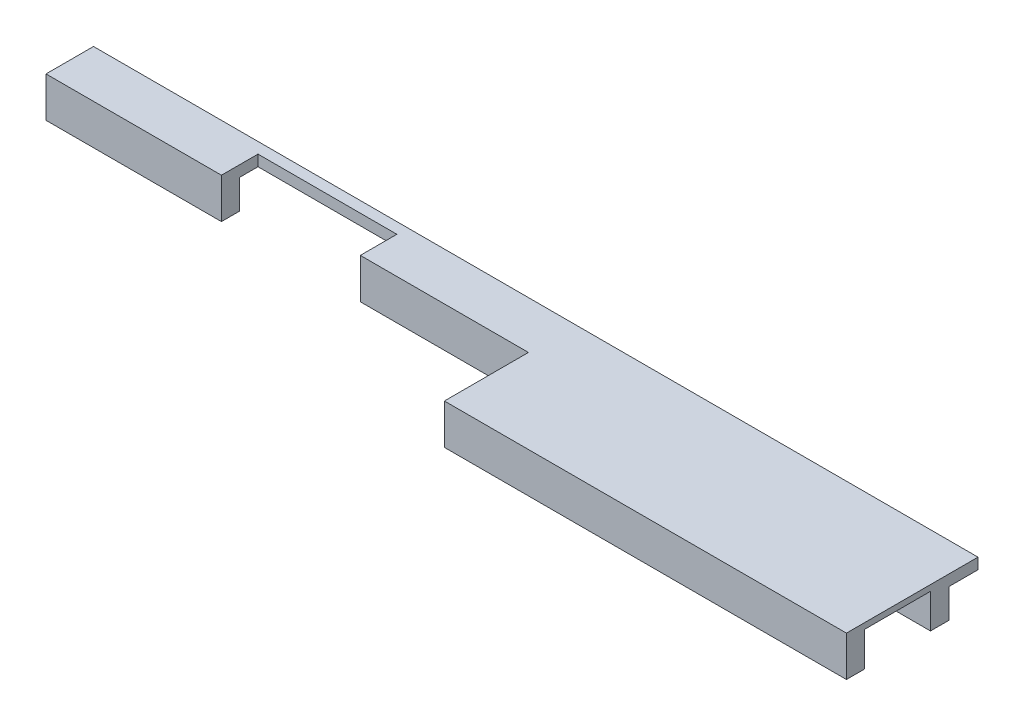
ISO-10303-21;
HEADER;
FILE_DESCRIPTION(('STEP AP214'),'2;1');
FILE_NAME('part.step','',(''),(''),'','','');
FILE_SCHEMA(('AUTOMOTIVE_DESIGN { 1 0 10303 214 1 1 1 1 }'));
ENDSEC;
DATA;
#1=APPLICATION_CONTEXT('core data for automotive mechanical design processes');
#2=APPLICATION_PROTOCOL_DEFINITION('international standard','automotive_design',2000,#1);
#3=PRODUCT_CONTEXT('',#1,'mechanical');
#4=PRODUCT('Part','Part','',(#3));
#5=PRODUCT_RELATED_PRODUCT_CATEGORY('part','',(#4));
#6=PRODUCT_DEFINITION_FORMATION('','',#4);
#7=PRODUCT_DEFINITION_CONTEXT('part definition',#1,'design');
#8=PRODUCT_DEFINITION('design','',#6,#7);
#9=PRODUCT_DEFINITION_SHAPE('','',#8);
#10=(LENGTH_UNIT() NAMED_UNIT(*) SI_UNIT(.MILLI.,.METRE.));
#11=(NAMED_UNIT(*) PLANE_ANGLE_UNIT() SI_UNIT($,.RADIAN.));
#12=(NAMED_UNIT(*) SI_UNIT($,.STERADIAN.) SOLID_ANGLE_UNIT());
#13=UNCERTAINTY_MEASURE_WITH_UNIT(LENGTH_MEASURE(1.E-05),#10,'distance_accuracy_value','');
#14=(GEOMETRIC_REPRESENTATION_CONTEXT(3) GLOBAL_UNCERTAINTY_ASSIGNED_CONTEXT((#13)) GLOBAL_UNIT_ASSIGNED_CONTEXT((#10,
#11,#12)) REPRESENTATION_CONTEXT('',''));
#15=CARTESIAN_POINT('',(0.,0.,0.));
#16=DIRECTION('',(0.,0.,1.));
#17=DIRECTION('',(1.,0.,0.));
#18=AXIS2_PLACEMENT_3D('',#15,#16,#17);
#19=CARTESIAN_POINT('',(-60.,-3.,68.5));
#20=DIRECTION('',(0.,0.,-1.));
#21=DIRECTION('',(-1.,0.,0.));
#22=AXIS2_PLACEMENT_3D('',#19,#20,#21);
#23=PLANE('',#22);
#24=DIRECTION('',(1.,0.,0.));
#25=VECTOR('',#24,1.);
#26=CARTESIAN_POINT('',(-60.,0.,68.5));
#27=LINE('',#26,#25);
#28=CARTESIAN_POINT('',(-67.,0.,68.5));
#29=VERTEX_POINT('',#28);
#30=CARTESIAN_POINT('',(-19.,0.,68.5));
#31=VERTEX_POINT('',#30);
#32=EDGE_CURVE('E195',#29,#31,#27,.T.);
#33=ORIENTED_EDGE('',*,*,#32,.F.);
#34=DIRECTION('',(0.,-1.,0.));
#35=VECTOR('',#34,1.);
#36=CARTESIAN_POINT('',(-67.,-11.,68.5));
#37=LINE('',#36,#35);
#38=CARTESIAN_POINT('',(-67.,-11.,68.5));
#39=VERTEX_POINT('',#38);
#40=EDGE_CURVE('E276',#29,#39,#37,.T.);
#41=ORIENTED_EDGE('',*,*,#40,.T.);
#42=DIRECTION('',(1.,0.,0.));
#43=VECTOR('',#42,1.);
#44=CARTESIAN_POINT('',(-60.,-11.,68.5));
#45=LINE('',#44,#43);
#46=CARTESIAN_POINT('',(-19.,-11.,68.5));
#47=VERTEX_POINT('',#46);
#48=EDGE_CURVE('E316',#39,#47,#45,.T.);
#49=ORIENTED_EDGE('',*,*,#48,.T.);
#50=DIRECTION('',(0.,-1.,0.));
#51=VECTOR('',#50,1.);
#52=CARTESIAN_POINT('',(-19.,14.,68.5));
#53=LINE('',#52,#51);
#54=EDGE_CURVE('E291',#31,#47,#53,.T.);
#55=ORIENTED_EDGE('',*,*,#54,.F.);
#56=EDGE_LOOP('',(#33,#41,#49,#55));
#57=FACE_BOUND('',#56,.T.);
#58=ADVANCED_FACE('F39',(#57),#23,.F.);
#59=CARTESIAN_POINT('',(-60.,-11.,63.5));
#60=DIRECTION('',(0.,0.,1.));
#61=DIRECTION('',(1.,0.,0.));
#62=AXIS2_PLACEMENT_3D('',#59,#60,#61);
#63=PLANE('',#62);
#64=DIRECTION('',(-1.,0.,0.));
#65=VECTOR('',#64,1.);
#66=CARTESIAN_POINT('',(-60.,-11.,63.5));
#67=LINE('',#66,#65);
#68=CARTESIAN_POINT('',(-19.,-11.,63.5));
#69=VERTEX_POINT('',#68);
#70=CARTESIAN_POINT('',(-67.,-11.,63.5));
#71=VERTEX_POINT('',#70);
#72=EDGE_CURVE('E319',#69,#71,#67,.T.);
#73=ORIENTED_EDGE('',*,*,#72,.T.);
#74=DIRECTION('',(0.,1.,0.));
#75=VECTOR('',#74,1.);
#76=CARTESIAN_POINT('',(-67.,-11.,63.5));
#77=LINE('',#76,#75);
#78=CARTESIAN_POINT('',(-67.,-3.,63.5));
#79=VERTEX_POINT('',#78);
#80=EDGE_CURVE('E183',#71,#79,#77,.T.);
#81=ORIENTED_EDGE('',*,*,#80,.T.);
#82=DIRECTION('',(-1.,0.,0.));
#83=VECTOR('',#82,1.);
#84=CARTESIAN_POINT('',(-60.,-3.,63.5));
#85=LINE('',#84,#83);
#86=CARTESIAN_POINT('',(-19.,-3.,63.5));
#87=VERTEX_POINT('',#86);
#88=EDGE_CURVE('E164',#87,#79,#85,.T.);
#89=ORIENTED_EDGE('',*,*,#88,.F.);
#90=DIRECTION('',(0.,1.,0.));
#91=VECTOR('',#90,1.);
#92=CARTESIAN_POINT('',(-19.,-11.,63.5));
#93=LINE('',#92,#91);
#94=EDGE_CURVE('E172',#69,#87,#93,.T.);
#95=ORIENTED_EDGE('',*,*,#94,.F.);
#96=EDGE_LOOP('',(#73,#81,#89,#95));
#97=FACE_BOUND('',#96,.T.);
#98=ADVANCED_FACE('F182',(#97),#63,.F.);
#99=CARTESIAN_POINT('',(0.,-11.,0.));
#100=DIRECTION('',(0.,1.,0.));
#101=DIRECTION('',(0.,0.,-1.));
#102=AXIS2_PLACEMENT_3D('',#99,#100,#101);
#103=PLANE('',#102);
#104=ORIENTED_EDGE('',*,*,#48,.F.);
#105=DIRECTION('',(0.,0.,-1.));
#106=VECTOR('',#105,1.);
#107=CARTESIAN_POINT('',(-67.,-11.,63.5));
#108=LINE('',#107,#106);
#109=EDGE_CURVE('E106',#39,#71,#108,.T.);
#110=ORIENTED_EDGE('',*,*,#109,.T.);
#111=ORIENTED_EDGE('',*,*,#72,.F.);
#112=DIRECTION('',(0.,0.,-1.));
#113=VECTOR('',#112,1.);
#114=CARTESIAN_POINT('',(-19.,-11.,0.));
#115=LINE('',#114,#113);
#116=EDGE_CURVE('E50',#47,#69,#115,.T.);
#117=ORIENTED_EDGE('',*,*,#116,.F.);
#118=EDGE_LOOP('',(#104,#110,#111,#117));
#119=FACE_BOUND('',#118,.T.);
#120=ADVANCED_FACE('F390',(#119),#103,.F.);
#121=CARTESIAN_POINT('',(0.,-3.,0.));
#122=DIRECTION('',(0.,1.,0.));
#123=DIRECTION('',(0.,0.,-1.));
#124=AXIS2_PLACEMENT_3D('',#121,#122,#123);
#125=PLANE('',#124);
#126=CARTESIAN_POINT('',(175.,-3.,63.5));
#127=VERTEX_POINT('',#126);
#128=CARTESIAN_POINT('',(19.,-3.,63.5));
#129=VERTEX_POINT('',#128);
#130=EDGE_CURVE('E185',#127,#129,#85,.T.);
#131=ORIENTED_EDGE('',*,*,#130,.T.);
#132=DIRECTION('',(0.,0.,1.));
#133=VECTOR('',#132,1.);
#134=CARTESIAN_POINT('',(19.,-3.,0.));
#135=LINE('',#134,#133);
#136=CARTESIAN_POINT('',(19.,-3.,58.5));
#137=VERTEX_POINT('',#136);
#138=EDGE_CURVE('E308',#137,#129,#135,.T.);
#139=ORIENTED_EDGE('',*,*,#138,.F.);
#140=DIRECTION('',(1.,0.,0.));
#141=VECTOR('',#140,1.);
#142=CARTESIAN_POINT('',(0.,-3.,58.5));
#143=LINE('',#142,#141);
#144=CARTESIAN_POINT('',(-19.,-3.,58.5));
#145=VERTEX_POINT('',#144);
#146=EDGE_CURVE('E168',#145,#137,#143,.T.);
#147=ORIENTED_EDGE('',*,*,#146,.F.);
#148=DIRECTION('',(0.,0.,-1.));
#149=VECTOR('',#148,1.);
#150=CARTESIAN_POINT('',(-19.,-3.,0.));
#151=LINE('',#150,#149);
#152=EDGE_CURVE('E158',#87,#145,#151,.T.);
#153=ORIENTED_EDGE('',*,*,#152,.F.);
#154=ORIENTED_EDGE('',*,*,#88,.T.);
#155=DIRECTION('',(0.,0.,-1.));
#156=VECTOR('',#155,1.);
#157=CARTESIAN_POINT('',(-67.,-3.,63.5));
#158=LINE('',#157,#156);
#159=CARTESIAN_POINT('',(-67.,-3.,55.5));
#160=VERTEX_POINT('',#159);
#161=EDGE_CURVE('E267',#79,#160,#158,.T.);
#162=ORIENTED_EDGE('',*,*,#161,.T.);
#163=DIRECTION('',(-1.,0.,0.));
#164=VECTOR('',#163,1.);
#165=CARTESIAN_POINT('',(0.,-3.,55.5));
#166=LINE('',#165,#164);
#167=CARTESIAN_POINT('',(175.,-3.,55.5));
#168=VERTEX_POINT('',#167);
#169=EDGE_CURVE('E284',#168,#160,#166,.T.);
#170=ORIENTED_EDGE('',*,*,#169,.F.);
#171=DIRECTION('',(0.,0.,1.));
#172=VECTOR('',#171,1.);
#173=CARTESIAN_POINT('',(175.,-3.,0.));
#174=LINE('',#173,#172);
#175=EDGE_CURVE('E210',#168,#127,#174,.T.);
#176=ORIENTED_EDGE('',*,*,#175,.T.);
#177=EDGE_LOOP('',(#131,#139,#147,#153,#154,#162,#170,#176));
#178=FACE_BOUND('',#177,.T.);
#179=ADVANCED_FACE('F161',(#178),#125,.F.);
#180=DIRECTION('',(-1.,0.,0.));
#181=VECTOR('',#180,1.);
#182=CARTESIAN_POINT('',(180.,-1.6,68.5));
#183=LINE('',#182,#181);
#184=CARTESIAN_POINT('',(175.,-1.6,68.5));
#185=VERTEX_POINT('',#184);
#186=CARTESIAN_POINT('',(65.,-1.6,68.5));
#187=VERTEX_POINT('',#186);
#188=EDGE_CURVE('E259',#185,#187,#183,.T.);
#189=ORIENTED_EDGE('',*,*,#188,.T.);
#190=DIRECTION('',(0.,-1.,0.));
#191=VECTOR('',#190,1.);
#192=CARTESIAN_POINT('',(65.,0.,68.5));
#193=LINE('',#192,#191);
#194=CARTESIAN_POINT('',(65.,0.,68.5));
#195=VERTEX_POINT('',#194);
#196=EDGE_CURVE('E344',#195,#187,#193,.T.);
#197=ORIENTED_EDGE('',*,*,#196,.F.);
#198=CARTESIAN_POINT('',(19.,0.,68.5));
#199=VERTEX_POINT('',#198);
#200=EDGE_CURVE('E199',#199,#195,#27,.T.);
#201=ORIENTED_EDGE('',*,*,#200,.F.);
#202=DIRECTION('',(0.,-1.,0.));
#203=VECTOR('',#202,1.);
#204=CARTESIAN_POINT('',(19.,14.,68.5));
#205=LINE('',#204,#203);
#206=CARTESIAN_POINT('',(19.,-11.,68.5));
#207=VERTEX_POINT('',#206);
#208=EDGE_CURVE('E299',#199,#207,#205,.T.);
#209=ORIENTED_EDGE('',*,*,#208,.T.);
#210=CARTESIAN_POINT('',(175.,-11.,68.5));
#211=VERTEX_POINT('',#210);
#212=EDGE_CURVE('E189',#207,#211,#45,.T.);
#213=ORIENTED_EDGE('',*,*,#212,.T.);
#214=DIRECTION('',(0.,1.,0.));
#215=VECTOR('',#214,1.);
#216=CARTESIAN_POINT('',(175.,0.,68.5));
#217=LINE('',#216,#215);
#218=EDGE_CURVE('E222',#211,#185,#217,.T.);
#219=ORIENTED_EDGE('',*,*,#218,.T.);
#220=EDGE_LOOP('',(#189,#197,#201,#209,#213,#219));
#221=FACE_BOUND('',#220,.T.);
#222=ADVANCED_FACE('F326',(#221),#23,.F.);
#223=CARTESIAN_POINT('',(0.,0.,0.));
#224=DIRECTION('',(0.,1.,0.));
#225=DIRECTION('',(0.,0.,-1.));
#226=AXIS2_PLACEMENT_3D('',#223,#224,#225);
#227=PLANE('',#226);
#228=DIRECTION('',(0.,0.,1.));
#229=VECTOR('',#228,1.);
#230=CARTESIAN_POINT('',(65.,0.,91.5));
#231=LINE('',#230,#229);
#232=CARTESIAN_POINT('',(65.,0.,91.5));
#233=VERTEX_POINT('',#232);
#234=EDGE_CURVE('E354',#195,#233,#231,.T.);
#235=ORIENTED_EDGE('',*,*,#234,.T.);
#236=DIRECTION('',(-1.,0.,0.));
#237=VECTOR('',#236,1.);
#238=CARTESIAN_POINT('',(180.,0.,91.5));
#239=LINE('',#238,#237);
#240=CARTESIAN_POINT('',(175.,0.,91.5));
#241=VERTEX_POINT('',#240);
#242=EDGE_CURVE('E240',#241,#233,#239,.T.);
#243=ORIENTED_EDGE('',*,*,#242,.F.);
#244=DIRECTION('',(0.,0.,-1.));
#245=VECTOR('',#244,1.);
#246=CARTESIAN_POINT('',(175.,0.,0.));
#247=LINE('',#246,#245);
#248=CARTESIAN_POINT('',(175.,0.,55.5));
#249=VERTEX_POINT('',#248);
#250=EDGE_CURVE('E202',#241,#249,#247,.T.);
#251=ORIENTED_EDGE('',*,*,#250,.T.);
#252=DIRECTION('',(1.,0.,0.));
#253=VECTOR('',#252,1.);
#254=CARTESIAN_POINT('',(-60.,0.,55.5));
#255=LINE('',#254,#253);
#256=CARTESIAN_POINT('',(-67.,0.,55.5));
#257=VERTEX_POINT('',#256);
#258=EDGE_CURVE('E280',#257,#249,#255,.T.);
#259=ORIENTED_EDGE('',*,*,#258,.F.);
#260=DIRECTION('',(0.,0.,1.));
#261=VECTOR('',#260,1.);
#262=CARTESIAN_POINT('',(-67.,0.,68.5));
#263=LINE('',#262,#261);
#264=EDGE_CURVE('E273',#257,#29,#263,.T.);
#265=ORIENTED_EDGE('',*,*,#264,.T.);
#266=ORIENTED_EDGE('',*,*,#32,.T.);
#267=DIRECTION('',(0.,0.,-1.));
#268=VECTOR('',#267,1.);
#269=CARTESIAN_POINT('',(-19.,0.,0.));
#270=LINE('',#269,#268);
#271=CARTESIAN_POINT('',(-19.,0.,58.5));
#272=VERTEX_POINT('',#271);
#273=EDGE_CURVE('E171',#31,#272,#270,.T.);
#274=ORIENTED_EDGE('',*,*,#273,.T.);
#275=DIRECTION('',(1.,0.,0.));
#276=VECTOR('',#275,1.);
#277=CARTESIAN_POINT('',(0.,0.,58.5));
#278=LINE('',#277,#276);
#279=CARTESIAN_POINT('',(19.,0.,58.5));
#280=VERTEX_POINT('',#279);
#281=EDGE_CURVE('E12',#272,#280,#278,.T.);
#282=ORIENTED_EDGE('',*,*,#281,.T.);
#283=DIRECTION('',(0.,0.,1.));
#284=VECTOR('',#283,1.);
#285=CARTESIAN_POINT('',(19.,0.,0.));
#286=LINE('',#285,#284);
#287=EDGE_CURVE('E180',#280,#199,#286,.T.);
#288=ORIENTED_EDGE('',*,*,#287,.T.);
#289=ORIENTED_EDGE('',*,*,#200,.T.);
#290=EDGE_LOOP('',(#235,#243,#251,#259,#265,#266,#274,#282,#288,#289));
#291=FACE_BOUND('',#290,.T.);
#292=ADVANCED_FACE('F353',(#291),#227,.T.);
#293=ORIENTED_EDGE('',*,*,#130,.F.);
#294=DIRECTION('',(0.,-1.,0.));
#295=VECTOR('',#294,1.);
#296=CARTESIAN_POINT('',(175.,0.,63.5));
#297=LINE('',#296,#295);
#298=CARTESIAN_POINT('',(175.,-11.,63.5));
#299=VERTEX_POINT('',#298);
#300=EDGE_CURVE('E214',#127,#299,#297,.T.);
#301=ORIENTED_EDGE('',*,*,#300,.T.);
#302=CARTESIAN_POINT('',(19.,-11.,63.5));
#303=VERTEX_POINT('',#302);
#304=EDGE_CURVE('E193',#299,#303,#67,.T.);
#305=ORIENTED_EDGE('',*,*,#304,.T.);
#306=DIRECTION('',(0.,-1.,0.));
#307=VECTOR('',#306,1.);
#308=CARTESIAN_POINT('',(19.,-11.,63.5));
#309=LINE('',#308,#307);
#310=EDGE_CURVE('E295',#129,#303,#309,.T.);
#311=ORIENTED_EDGE('',*,*,#310,.F.);
#312=EDGE_LOOP('',(#293,#301,#305,#311));
#313=FACE_BOUND('',#312,.T.);
#314=ADVANCED_FACE('F360',(#313),#63,.F.);
#315=ORIENTED_EDGE('',*,*,#304,.F.);
#316=DIRECTION('',(0.,0.,1.));
#317=VECTOR('',#316,1.);
#318=CARTESIAN_POINT('',(175.,-11.,0.));
#319=LINE('',#318,#317);
#320=EDGE_CURVE('E218',#299,#211,#319,.T.);
#321=ORIENTED_EDGE('',*,*,#320,.T.);
#322=ORIENTED_EDGE('',*,*,#212,.F.);
#323=DIRECTION('',(0.,0.,-1.));
#324=VECTOR('',#323,1.);
#325=CARTESIAN_POINT('',(19.,-11.,58.5));
#326=LINE('',#325,#324);
#327=EDGE_CURVE('E288',#207,#303,#326,.T.);
#328=ORIENTED_EDGE('',*,*,#327,.T.);
#329=EDGE_LOOP('',(#315,#321,#322,#328));
#330=FACE_BOUND('',#329,.T.);
#331=ADVANCED_FACE('F332',(#330),#103,.F.);
#332=CARTESIAN_POINT('',(-19.,14.,58.5));
#333=DIRECTION('',(0.,0.,-1.));
#334=DIRECTION('',(-1.,0.,0.));
#335=AXIS2_PLACEMENT_3D('',#332,#333,#334);
#336=PLANE('',#335);
#337=DIRECTION('',(0.,-1.,0.));
#338=VECTOR('',#337,1.);
#339=CARTESIAN_POINT('',(-19.,14.,58.5));
#340=LINE('',#339,#338);
#341=EDGE_CURVE('E292',#272,#145,#340,.T.);
#342=ORIENTED_EDGE('',*,*,#341,.T.);
#343=ORIENTED_EDGE('',*,*,#146,.T.);
#344=DIRECTION('',(0.,-1.,0.));
#345=VECTOR('',#344,1.);
#346=CARTESIAN_POINT('',(19.,14.,58.5));
#347=LINE('',#346,#345);
#348=EDGE_CURVE('E296',#280,#137,#347,.T.);
#349=ORIENTED_EDGE('',*,*,#348,.F.);
#350=ORIENTED_EDGE('',*,*,#281,.F.);
#351=EDGE_LOOP('',(#342,#343,#349,#350));
#352=FACE_BOUND('',#351,.T.);
#353=ADVANCED_FACE('F373',(#352),#336,.F.);
#354=CARTESIAN_POINT('',(-19.,14.,58.5));
#355=DIRECTION('',(-1.,0.,0.));
#356=DIRECTION('',(0.,0.,1.));
#357=AXIS2_PLACEMENT_3D('',#354,#355,#356);
#358=PLANE('',#357);
#359=ORIENTED_EDGE('',*,*,#273,.F.);
#360=ORIENTED_EDGE('',*,*,#54,.T.);
#361=ORIENTED_EDGE('',*,*,#116,.T.);
#362=ORIENTED_EDGE('',*,*,#94,.T.);
#363=ORIENTED_EDGE('',*,*,#152,.T.);
#364=ORIENTED_EDGE('',*,*,#341,.F.);
#365=EDGE_LOOP('',(#359,#360,#361,#362,#363,#364));
#366=FACE_BOUND('',#365,.T.);
#367=ADVANCED_FACE('F175',(#366),#358,.F.);
#368=CARTESIAN_POINT('',(19.,14.,58.5));
#369=DIRECTION('',(1.,0.,0.));
#370=DIRECTION('',(0.,0.,-1.));
#371=AXIS2_PLACEMENT_3D('',#368,#369,#370);
#372=PLANE('',#371);
#373=ORIENTED_EDGE('',*,*,#287,.F.);
#374=ORIENTED_EDGE('',*,*,#348,.T.);
#375=ORIENTED_EDGE('',*,*,#138,.T.);
#376=ORIENTED_EDGE('',*,*,#310,.T.);
#377=ORIENTED_EDGE('',*,*,#327,.F.);
#378=ORIENTED_EDGE('',*,*,#208,.F.);
#379=EDGE_LOOP('',(#373,#374,#375,#376,#377,#378));
#380=FACE_BOUND('',#379,.T.);
#381=ADVANCED_FACE('F375',(#380),#372,.F.);
#382=CARTESIAN_POINT('',(-60.,0.,55.5));
#383=DIRECTION('',(0.,0.,1.));
#384=DIRECTION('',(1.,0.,0.));
#385=AXIS2_PLACEMENT_3D('',#382,#383,#384);
#386=PLANE('',#385);
#387=ORIENTED_EDGE('',*,*,#169,.T.);
#388=DIRECTION('',(0.,1.,0.));
#389=VECTOR('',#388,1.);
#390=CARTESIAN_POINT('',(-67.,0.,55.5));
#391=LINE('',#390,#389);
#392=EDGE_CURVE('E270',#160,#257,#391,.T.);
#393=ORIENTED_EDGE('',*,*,#392,.T.);
#394=ORIENTED_EDGE('',*,*,#258,.T.);
#395=DIRECTION('',(0.,-1.,0.));
#396=VECTOR('',#395,1.);
#397=CARTESIAN_POINT('',(175.,0.,55.5));
#398=LINE('',#397,#396);
#399=EDGE_CURVE('E206',#249,#168,#398,.T.);
#400=ORIENTED_EDGE('',*,*,#399,.T.);
#401=EDGE_LOOP('',(#387,#393,#394,#400));
#402=FACE_BOUND('',#401,.T.);
#403=ADVANCED_FACE('F364',(#402),#386,.F.);
#404=CARTESIAN_POINT('',(-67.,0.,0.));
#405=DIRECTION('',(1.,0.,0.));
#406=DIRECTION('',(0.,0.,-1.));
#407=AXIS2_PLACEMENT_3D('',#404,#405,#406);
#408=PLANE('',#407);
#409=ORIENTED_EDGE('',*,*,#109,.F.);
#410=ORIENTED_EDGE('',*,*,#40,.F.);
#411=ORIENTED_EDGE('',*,*,#264,.F.);
#412=ORIENTED_EDGE('',*,*,#392,.F.);
#413=ORIENTED_EDGE('',*,*,#161,.F.);
#414=ORIENTED_EDGE('',*,*,#80,.F.);
#415=EDGE_LOOP('',(#409,#410,#411,#412,#413,#414));
#416=FACE_BOUND('',#415,.T.);
#417=ADVANCED_FACE('F370',(#416),#408,.F.);
#418=CARTESIAN_POINT('',(180.,-1.6,68.5));
#419=DIRECTION('',(0.,1.,0.));
#420=DIRECTION('',(0.,0.,-1.));
#421=AXIS2_PLACEMENT_3D('',#418,#419,#420);
#422=PLANE('',#421);
#423=DIRECTION('',(-1.,0.,0.));
#424=VECTOR('',#423,1.);
#425=CARTESIAN_POINT('',(180.,-1.6,86.5));
#426=LINE('',#425,#424);
#427=CARTESIAN_POINT('',(175.,-1.6,86.5));
#428=VERTEX_POINT('',#427);
#429=CARTESIAN_POINT('',(65.,-1.6,86.5));
#430=VERTEX_POINT('',#429);
#431=EDGE_CURVE('E255',#428,#430,#426,.T.);
#432=ORIENTED_EDGE('',*,*,#431,.T.);
#433=DIRECTION('',(0.,0.,-1.));
#434=VECTOR('',#433,1.);
#435=CARTESIAN_POINT('',(65.,-1.6,68.5));
#436=LINE('',#435,#434);
#437=EDGE_CURVE('E207',#430,#187,#436,.T.);
#438=ORIENTED_EDGE('',*,*,#437,.T.);
#439=ORIENTED_EDGE('',*,*,#188,.F.);
#440=DIRECTION('',(0.,0.,1.));
#441=VECTOR('',#440,1.);
#442=CARTESIAN_POINT('',(175.,-1.60000000000001,0.));
#443=LINE('',#442,#441);
#444=EDGE_CURVE('E226',#185,#428,#443,.T.);
#445=ORIENTED_EDGE('',*,*,#444,.T.);
#446=EDGE_LOOP('',(#432,#438,#439,#445));
#447=FACE_BOUND('',#446,.T.);
#448=ADVANCED_FACE('F338',(#447),#422,.F.);
#449=CARTESIAN_POINT('',(180.,-1.6,86.5));
#450=DIRECTION('',(0.,0.,1.));
#451=DIRECTION('',(1.,0.,0.));
#452=AXIS2_PLACEMENT_3D('',#449,#450,#451);
#453=PLANE('',#452);
#454=DIRECTION('',(-1.,0.,0.));
#455=VECTOR('',#454,1.);
#456=CARTESIAN_POINT('',(180.,-11.,86.5));
#457=LINE('',#456,#455);
#458=CARTESIAN_POINT('',(175.,-11.,86.5));
#459=VERTEX_POINT('',#458);
#460=CARTESIAN_POINT('',(65.,-11.,86.5));
#461=VERTEX_POINT('',#460);
#462=EDGE_CURVE('E247',#459,#461,#457,.T.);
#463=ORIENTED_EDGE('',*,*,#462,.T.);
#464=DIRECTION('',(0.,1.,0.));
#465=VECTOR('',#464,1.);
#466=CARTESIAN_POINT('',(65.,-1.6,86.5));
#467=LINE('',#466,#465);
#468=EDGE_CURVE('E432',#461,#430,#467,.T.);
#469=ORIENTED_EDGE('',*,*,#468,.T.);
#470=ORIENTED_EDGE('',*,*,#431,.F.);
#471=DIRECTION('',(0.,-1.,0.));
#472=VECTOR('',#471,1.);
#473=CARTESIAN_POINT('',(175.,0.,86.5));
#474=LINE('',#473,#472);
#475=EDGE_CURVE('E230',#428,#459,#474,.T.);
#476=ORIENTED_EDGE('',*,*,#475,.T.);
#477=EDGE_LOOP('',(#463,#469,#470,#476));
#478=FACE_BOUND('',#477,.T.);
#479=ADVANCED_FACE('F416',(#478),#453,.F.);
#480=CARTESIAN_POINT('',(180.,-11.,86.5));
#481=DIRECTION('',(0.,1.,0.));
#482=DIRECTION('',(0.,0.,-1.));
#483=AXIS2_PLACEMENT_3D('',#480,#481,#482);
#484=PLANE('',#483);
#485=DIRECTION('',(-1.,0.,0.));
#486=VECTOR('',#485,1.);
#487=CARTESIAN_POINT('',(180.,-11.,91.5));
#488=LINE('',#487,#486);
#489=CARTESIAN_POINT('',(175.,-11.,91.5));
#490=VERTEX_POINT('',#489);
#491=CARTESIAN_POINT('',(65.,-11.,91.5));
#492=VERTEX_POINT('',#491);
#493=EDGE_CURVE('E242',#490,#492,#488,.T.);
#494=ORIENTED_EDGE('',*,*,#493,.T.);
#495=DIRECTION('',(0.,0.,-1.));
#496=VECTOR('',#495,1.);
#497=CARTESIAN_POINT('',(65.,-11.,86.5));
#498=LINE('',#497,#496);
#499=EDGE_CURVE('E59',#492,#461,#498,.T.);
#500=ORIENTED_EDGE('',*,*,#499,.T.);
#501=ORIENTED_EDGE('',*,*,#462,.F.);
#502=DIRECTION('',(0.,0.,1.));
#503=VECTOR('',#502,1.);
#504=CARTESIAN_POINT('',(175.,-11.,0.));
#505=LINE('',#504,#503);
#506=EDGE_CURVE('E233',#459,#490,#505,.T.);
#507=ORIENTED_EDGE('',*,*,#506,.T.);
#508=EDGE_LOOP('',(#494,#500,#501,#507));
#509=FACE_BOUND('',#508,.T.);
#510=ADVANCED_FACE('F419',(#509),#484,.F.);
#511=CARTESIAN_POINT('',(180.,-11.,91.5));
#512=DIRECTION('',(0.,0.,-1.));
#513=DIRECTION('',(-1.,0.,0.));
#514=AXIS2_PLACEMENT_3D('',#511,#512,#513);
#515=PLANE('',#514);
#516=ORIENTED_EDGE('',*,*,#242,.T.);
#517=DIRECTION('',(0.,-1.,0.));
#518=VECTOR('',#517,1.);
#519=CARTESIAN_POINT('',(65.,0.,91.5));
#520=LINE('',#519,#518);
#521=EDGE_CURVE('E435',#233,#492,#520,.T.);
#522=ORIENTED_EDGE('',*,*,#521,.T.);
#523=ORIENTED_EDGE('',*,*,#493,.F.);
#524=DIRECTION('',(0.,1.,0.));
#525=VECTOR('',#524,1.);
#526=CARTESIAN_POINT('',(175.,0.,91.5));
#527=LINE('',#526,#525);
#528=EDGE_CURVE('E43',#490,#241,#527,.T.);
#529=ORIENTED_EDGE('',*,*,#528,.T.);
#530=EDGE_LOOP('',(#516,#522,#523,#529));
#531=FACE_BOUND('',#530,.T.);
#532=ADVANCED_FACE('F423',(#531),#515,.F.);
#533=CARTESIAN_POINT('',(175.,0.,0.));
#534=DIRECTION('',(1.,0.,0.));
#535=DIRECTION('',(0.,0.,-1.));
#536=AXIS2_PLACEMENT_3D('',#533,#534,#535);
#537=PLANE('',#536);
#538=ORIENTED_EDGE('',*,*,#250,.F.);
#539=ORIENTED_EDGE('',*,*,#528,.F.);
#540=ORIENTED_EDGE('',*,*,#506,.F.);
#541=ORIENTED_EDGE('',*,*,#475,.F.);
#542=ORIENTED_EDGE('',*,*,#444,.F.);
#543=ORIENTED_EDGE('',*,*,#218,.F.);
#544=ORIENTED_EDGE('',*,*,#320,.F.);
#545=ORIENTED_EDGE('',*,*,#300,.F.);
#546=ORIENTED_EDGE('',*,*,#175,.F.);
#547=ORIENTED_EDGE('',*,*,#399,.F.);
#548=EDGE_LOOP('',(#538,#539,#540,#541,#542,#543,#544,#545,#546,#547));
#549=FACE_BOUND('',#548,.T.);
#550=ADVANCED_FACE('F41',(#549),#537,.T.);
#551=CARTESIAN_POINT('',(65.,0.,91.5));
#552=DIRECTION('',(1.,0.,0.));
#553=DIRECTION('',(0.,0.,-1.));
#554=AXIS2_PLACEMENT_3D('',#551,#552,#553);
#555=PLANE('',#554);
#556=ORIENTED_EDGE('',*,*,#468,.F.);
#557=ORIENTED_EDGE('',*,*,#499,.F.);
#558=ORIENTED_EDGE('',*,*,#521,.F.);
#559=ORIENTED_EDGE('',*,*,#234,.F.);
#560=ORIENTED_EDGE('',*,*,#196,.T.);
#561=ORIENTED_EDGE('',*,*,#437,.F.);
#562=EDGE_LOOP('',(#556,#557,#558,#559,#560,#561));
#563=FACE_BOUND('',#562,.T.);
#564=ADVANCED_FACE('F426',(#563),#555,.F.);
#565=CLOSED_SHELL('',(#58,#98,#120,#179,#222,#292,#314,#331,#353,#367,#381,#403,#417,#448,#479,
#510,#532,#550,#564));
#566=MANIFOLD_SOLID_BREP('B2',#565);
#567=ADVANCED_BREP_SHAPE_REPRESENTATION('',(#18,#566),#14);
#568=SHAPE_DEFINITION_REPRESENTATION(#9,#567);
ENDSEC;
END-ISO-10303-21;
